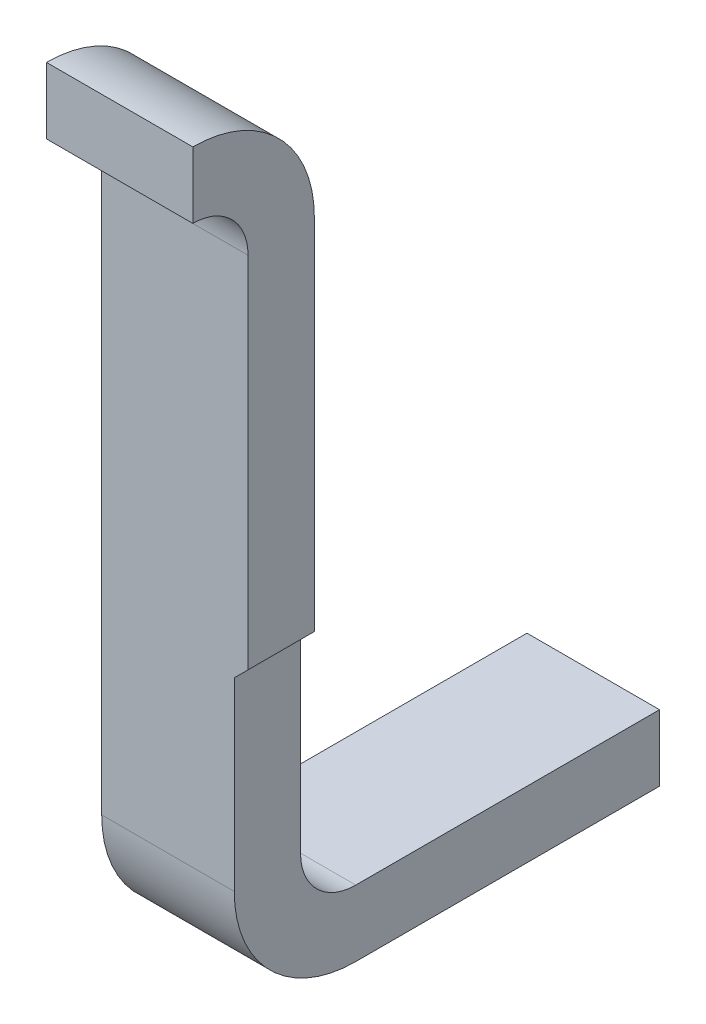
ISO-10303-21;
HEADER;
FILE_DESCRIPTION(('STEP AP214'),'2;1');
FILE_NAME('part.step','',(''),(''),'','','');
FILE_SCHEMA(('AUTOMOTIVE_DESIGN { 1 0 10303 214 1 1 1 1 }'));
ENDSEC;
DATA;
#1=APPLICATION_CONTEXT('core data for automotive mechanical design processes');
#2=APPLICATION_PROTOCOL_DEFINITION('international standard','automotive_design',2000,#1);
#3=PRODUCT_CONTEXT('',#1,'mechanical');
#4=PRODUCT('Part','Part','',(#3));
#5=PRODUCT_RELATED_PRODUCT_CATEGORY('part','',(#4));
#6=PRODUCT_DEFINITION_FORMATION('','',#4);
#7=PRODUCT_DEFINITION_CONTEXT('part definition',#1,'design');
#8=PRODUCT_DEFINITION('design','',#6,#7);
#9=PRODUCT_DEFINITION_SHAPE('','',#8);
#10=(LENGTH_UNIT() NAMED_UNIT(*) SI_UNIT(.MILLI.,.METRE.));
#11=(NAMED_UNIT(*) PLANE_ANGLE_UNIT() SI_UNIT($,.RADIAN.));
#12=(NAMED_UNIT(*) SI_UNIT($,.STERADIAN.) SOLID_ANGLE_UNIT());
#13=UNCERTAINTY_MEASURE_WITH_UNIT(LENGTH_MEASURE(1.E-05),#10,'distance_accuracy_value','');
#14=(GEOMETRIC_REPRESENTATION_CONTEXT(3) GLOBAL_UNCERTAINTY_ASSIGNED_CONTEXT((#13)) GLOBAL_UNIT_ASSIGNED_CONTEXT((#10,
#11,#12)) REPRESENTATION_CONTEXT('',''));
#15=CARTESIAN_POINT('',(0.,0.,0.));
#16=DIRECTION('',(0.,0.,1.));
#17=DIRECTION('',(1.,0.,0.));
#18=AXIS2_PLACEMENT_3D('',#15,#16,#17);
#19=CARTESIAN_POINT('',(13.46210817501,11.48941215274,-11.17169883308));
#20=DIRECTION('',(0.,0.,-1.));
#21=DIRECTION('',(-1.,0.,0.));
#22=AXIS2_PLACEMENT_3D('',#19,#20,#21);
#23=PLANE('',#22);
#24=DIRECTION('',(-1.,0.,0.));
#25=VECTOR('',#24,1.);
#26=CARTESIAN_POINT('',(13.11210817501,12.93951558355,-11.17169883308));
#27=LINE('',#26,#25);
#28=CARTESIAN_POINT('',(13.91210814532,12.93951558355,-11.17169883308));
#29=VERTEX_POINT('',#28);
#30=CARTESIAN_POINT('',(13.64710814532,12.93951558355,-11.17169883308));
#31=VERTEX_POINT('',#30);
#32=EDGE_CURVE('E225',#29,#31,#27,.T.);
#33=ORIENTED_EDGE('',*,*,#32,.T.);
#34=DIRECTION('',(0.,-1.,0.));
#35=VECTOR('',#34,1.);
#36=CARTESIAN_POINT('',(13.64710814532,5.079903349409,-11.17169883308));
#37=LINE('',#36,#35);
#38=CARTESIAN_POINT('',(13.64710814532,12.81951558355,-11.17169883308));
#39=VERTEX_POINT('',#38);
#40=EDGE_CURVE('E219',#31,#39,#37,.T.);
#41=ORIENTED_EDGE('',*,*,#40,.T.);
#42=DIRECTION('',(1.,0.,0.));
#43=VECTOR('',#42,1.);
#44=CARTESIAN_POINT('',(0.,12.81951558355,-11.17169883308));
#45=LINE('',#44,#43);
#46=CARTESIAN_POINT('',(13.91210814532,12.81951558355,-11.17169883308));
#47=VERTEX_POINT('',#46);
#48=EDGE_CURVE('E217',#39,#47,#45,.T.);
#49=ORIENTED_EDGE('',*,*,#48,.T.);
#50=DIRECTION('',(0.,1.,0.));
#51=VECTOR('',#50,1.);
#52=CARTESIAN_POINT('',(13.91210814532,5.079903349409,-11.17169883308));
#53=LINE('',#52,#51);
#54=EDGE_CURVE('E11',#47,#29,#53,.T.);
#55=ORIENTED_EDGE('',*,*,#54,.T.);
#56=EDGE_LOOP('',(#33,#41,#49,#55));
#57=FACE_BOUND('',#56,.T.);
#58=ADVANCED_FACE('F17',(#57),#23,.F.);
#59=CARTESIAN_POINT('',(13.91210814532,11.48951558355,-11.91169883308));
#60=DIRECTION('',(-1.,0.,0.));
#61=DIRECTION('',(0.,1.,0.));
#62=AXIS2_PLACEMENT_3D('',#59,#60,#61);
#63=PLANE('',#62);
#64=CARTESIAN_POINT('',(13.91210814532,12.71951558355,-11.17169883308));
#65=DIRECTION('',(1.,0.,0.));
#66=DIRECTION('',(0.,0.,-1.));
#67=AXIS2_PLACEMENT_3D('',#64,#65,#66);
#68=CIRCLE('',#67,0.1);
#69=CARTESIAN_POINT('',(13.91210814532,12.71951558355,-11.27169883308));
#70=VERTEX_POINT('',#69);
#71=EDGE_CURVE('E220',#70,#47,#68,.T.);
#72=ORIENTED_EDGE('',*,*,#71,.F.);
#73=DIRECTION('',(0.,1.,0.));
#74=VECTOR('',#73,1.);
#75=CARTESIAN_POINT('',(13.91210814532,11.48951558355,-11.27169883308));
#76=LINE('',#75,#74);
#77=CARTESIAN_POINT('',(13.91210814532,12.06951558355,-11.27169883308));
#78=VERTEX_POINT('',#77);
#79=EDGE_CURVE('E194',#78,#70,#76,.T.);
#80=ORIENTED_EDGE('',*,*,#79,.F.);
#81=DIRECTION('',(0.,0.,1.));
#82=VECTOR('',#81,1.);
#83=CARTESIAN_POINT('',(13.91210814532,12.06951558355,-11.91169883308));
#84=LINE('',#83,#82);
#85=CARTESIAN_POINT('',(13.91210814532,12.06951558355,-11.39169883308));
#86=VERTEX_POINT('',#85);
#87=EDGE_CURVE('E146',#86,#78,#84,.T.);
#88=ORIENTED_EDGE('',*,*,#87,.F.);
#89=DIRECTION('',(0.,-1.,0.));
#90=VECTOR('',#89,1.);
#91=CARTESIAN_POINT('',(13.91210814532,11.48951558355,-11.39169883308));
#92=LINE('',#91,#90);
#93=CARTESIAN_POINT('',(13.91210814532,12.71951558355,-11.39169883308));
#94=VERTEX_POINT('',#93);
#95=EDGE_CURVE('E193',#94,#86,#92,.T.);
#96=ORIENTED_EDGE('',*,*,#95,.F.);
#97=CARTESIAN_POINT('',(13.91210814532,12.71951558355,-11.17169883308));
#98=DIRECTION('',(-1.,0.,0.));
#99=DIRECTION('',(0.,0.,1.));
#100=AXIS2_PLACEMENT_3D('',#97,#98,#99);
#101=CIRCLE('',#100,0.22);
#102=EDGE_CURVE('E28',#29,#94,#101,.T.);
#103=ORIENTED_EDGE('',*,*,#102,.F.);
#104=ORIENTED_EDGE('',*,*,#54,.F.);
#105=EDGE_LOOP('',(#72,#80,#88,#96,#103,#104));
#106=FACE_BOUND('',#105,.T.);
#107=ADVANCED_FACE('F287',(#106),#63,.F.);
#108=CARTESIAN_POINT('',(12.81210814532,12.71951558355,-11.17169883308));
#109=DIRECTION('',(1.,0.,0.));
#110=DIRECTION('',(0.,0.,1.));
#111=AXIS2_PLACEMENT_3D('',#108,#109,#110);
#112=CYLINDRICAL_SURFACE('',#111,0.22);
#113=CARTESIAN_POINT('',(13.64710814532,12.71951558355,-11.17169883308));
#114=DIRECTION('',(-1.,0.,0.));
#115=DIRECTION('',(0.,0.,1.));
#116=AXIS2_PLACEMENT_3D('',#113,#114,#115);
#117=CIRCLE('',#116,0.22);
#118=CARTESIAN_POINT('',(13.64710814532,12.71951558355,-11.39169883308));
#119=VERTEX_POINT('',#118);
#120=EDGE_CURVE('E222',#31,#119,#117,.T.);
#121=ORIENTED_EDGE('',*,*,#120,.F.);
#122=ORIENTED_EDGE('',*,*,#32,.F.);
#123=ORIENTED_EDGE('',*,*,#102,.T.);
#124=DIRECTION('',(-1.,0.,0.));
#125=VECTOR('',#124,1.);
#126=CARTESIAN_POINT('',(12.81210814532,12.71951558355,-11.39169883308));
#127=LINE('',#126,#125);
#128=EDGE_CURVE('E192',#94,#119,#127,.T.);
#129=ORIENTED_EDGE('',*,*,#128,.T.);
#130=EDGE_LOOP('',(#121,#122,#123,#129));
#131=FACE_BOUND('',#130,.T.);
#132=ADVANCED_FACE('F429',(#131),#112,.T.);
#133=CARTESIAN_POINT('',(13.64710814532,12.71951558355,-11.17169883308));
#134=DIRECTION('',(-1.,0.,0.));
#135=DIRECTION('',(0.,1.,0.));
#136=AXIS2_PLACEMENT_3D('',#133,#134,#135);
#137=PLANE('',#136);
#138=CARTESIAN_POINT('',(13.64710814532,12.71951558355,-11.17169883308));
#139=DIRECTION('',(1.,0.,0.));
#140=DIRECTION('',(0.,0.,-1.));
#141=AXIS2_PLACEMENT_3D('',#138,#139,#140);
#142=CIRCLE('',#141,0.1);
#143=CARTESIAN_POINT('',(13.64710814532,12.71951558355,-11.27169883308));
#144=VERTEX_POINT('',#143);
#145=EDGE_CURVE('E233',#144,#39,#142,.T.);
#146=ORIENTED_EDGE('',*,*,#145,.T.);
#147=ORIENTED_EDGE('',*,*,#40,.F.);
#148=ORIENTED_EDGE('',*,*,#120,.T.);
#149=DIRECTION('',(0.,-1.,0.));
#150=VECTOR('',#149,1.);
#151=CARTESIAN_POINT('',(13.64710814532,12.71951558355,-11.39169883308));
#152=LINE('',#151,#150);
#153=CARTESIAN_POINT('',(13.64710814532,11.70951558355,-11.39169883308));
#154=VERTEX_POINT('',#153);
#155=EDGE_CURVE('E127',#119,#154,#152,.T.);
#156=ORIENTED_EDGE('',*,*,#155,.T.);
#157=CARTESIAN_POINT('',(13.64710814532,11.70951558355,-11.49169883308));
#158=DIRECTION('',(1.,0.,0.));
#159=DIRECTION('',(0.,0.,1.));
#160=AXIS2_PLACEMENT_3D('',#157,#158,#159);
#161=CIRCLE('',#160,0.1);
#162=CARTESIAN_POINT('',(13.64710814532,11.60951558355,-11.49169883308));
#163=VERTEX_POINT('',#162);
#164=EDGE_CURVE('E119',#154,#163,#161,.T.);
#165=ORIENTED_EDGE('',*,*,#164,.T.);
#166=DIRECTION('',(0.,0.,-1.));
#167=VECTOR('',#166,1.);
#168=CARTESIAN_POINT('',(13.64710814532,11.60951558355,-11.17169883308));
#169=LINE('',#168,#167);
#170=CARTESIAN_POINT('',(13.64710814532,11.60951558355,-12.04169883308));
#171=VERTEX_POINT('',#170);
#172=EDGE_CURVE('E213',#163,#171,#169,.T.);
#173=ORIENTED_EDGE('',*,*,#172,.T.);
#174=DIRECTION('',(0.,-1.,0.));
#175=VECTOR('',#174,1.);
#176=CARTESIAN_POINT('',(13.64710814532,12.71951558355,-12.04169883308));
#177=LINE('',#176,#175);
#178=CARTESIAN_POINT('',(13.64710814532,11.48951558355,-12.04169883308));
#179=VERTEX_POINT('',#178);
#180=EDGE_CURVE('E216',#171,#179,#177,.T.);
#181=ORIENTED_EDGE('',*,*,#180,.T.);
#182=DIRECTION('',(0.,0.,1.));
#183=VECTOR('',#182,1.);
#184=CARTESIAN_POINT('',(13.64710814532,11.48951558355,-11.17169883308));
#185=LINE('',#184,#183);
#186=CARTESIAN_POINT('',(13.64710814532,11.48951558355,-11.49169883308));
#187=VERTEX_POINT('',#186);
#188=EDGE_CURVE('E21',#179,#187,#185,.T.);
#189=ORIENTED_EDGE('',*,*,#188,.T.);
#190=CARTESIAN_POINT('',(13.64710814532,11.70951558355,-11.49169883308));
#191=DIRECTION('',(-1.,0.,0.));
#192=DIRECTION('',(0.,0.,-1.));
#193=AXIS2_PLACEMENT_3D('',#190,#191,#192);
#194=CIRCLE('',#193,0.22);
#195=CARTESIAN_POINT('',(13.64710814532,11.70951558355,-11.27169883308));
#196=VERTEX_POINT('',#195);
#197=EDGE_CURVE('E231',#187,#196,#194,.T.);
#198=ORIENTED_EDGE('',*,*,#197,.T.);
#199=DIRECTION('',(0.,1.,0.));
#200=VECTOR('',#199,1.);
#201=CARTESIAN_POINT('',(13.64710814532,12.71951558355,-11.27169883308));
#202=LINE('',#201,#200);
#203=EDGE_CURVE('E202',#196,#144,#202,.T.);
#204=ORIENTED_EDGE('',*,*,#203,.T.);
#205=EDGE_LOOP('',(#146,#147,#148,#156,#165,#173,#181,#189,#198,#204));
#206=FACE_BOUND('',#205,.T.);
#207=ADVANCED_FACE('F384',(#206),#137,.T.);
#208=CARTESIAN_POINT('',(19.01210814532,12.71951558355,-11.17169883308));
#209=DIRECTION('',(-1.,0.,0.));
#210=DIRECTION('',(0.,0.,-1.));
#211=AXIS2_PLACEMENT_3D('',#208,#209,#210);
#212=CYLINDRICAL_SURFACE('',#211,0.1);
#213=ORIENTED_EDGE('',*,*,#145,.F.);
#214=DIRECTION('',(-1.,0.,0.));
#215=VECTOR('',#214,1.);
#216=CARTESIAN_POINT('',(19.01210814532,12.71951558355,-11.27169883308));
#217=LINE('',#216,#215);
#218=EDGE_CURVE('E196',#70,#144,#217,.T.);
#219=ORIENTED_EDGE('',*,*,#218,.F.);
#220=ORIENTED_EDGE('',*,*,#71,.T.);
#221=ORIENTED_EDGE('',*,*,#48,.F.);
#222=EDGE_LOOP('',(#213,#219,#220,#221));
#223=FACE_BOUND('',#222,.T.);
#224=ADVANCED_FACE('F285',(#223),#212,.F.);
#225=CARTESIAN_POINT('',(13.61210814532,11.48951558355,-11.27169883308));
#226=DIRECTION('',(0.,0.,1.));
#227=DIRECTION('',(1.,0.,0.));
#228=AXIS2_PLACEMENT_3D('',#225,#226,#227);
#229=PLANE('',#228);
#230=DIRECTION('',(0.,1.,0.));
#231=VECTOR('',#230,1.);
#232=CARTESIAN_POINT('',(13.88710814532,11.48951558355,-11.27169883308));
#233=LINE('',#232,#231);
#234=CARTESIAN_POINT('',(13.88710814532,11.70951558355,-11.27169883308));
#235=VERTEX_POINT('',#234);
#236=CARTESIAN_POINT('',(13.88710814532,12.04451558355,-11.27169883308));
#237=VERTEX_POINT('',#236);
#238=EDGE_CURVE('E153',#235,#237,#233,.T.);
#239=ORIENTED_EDGE('',*,*,#238,.T.);
#240=DIRECTION('',(0.707106781186548,0.707106781186548,0.));
#241=VECTOR('',#240,1.);
#242=CARTESIAN_POINT('',(13.88710814532,12.04451558355,-11.27169883308));
#243=LINE('',#242,#241);
#244=EDGE_CURVE('E138',#237,#78,#243,.T.);
#245=ORIENTED_EDGE('',*,*,#244,.T.);
#246=ORIENTED_EDGE('',*,*,#79,.T.);
#247=ORIENTED_EDGE('',*,*,#218,.T.);
#248=ORIENTED_EDGE('',*,*,#203,.F.);
#249=DIRECTION('',(1.,0.,0.));
#250=VECTOR('',#249,1.);
#251=CARTESIAN_POINT('',(13.61210814532,11.70951558355,-11.27169883308));
#252=LINE('',#251,#250);
#253=EDGE_CURVE('E150',#196,#235,#252,.T.);
#254=ORIENTED_EDGE('',*,*,#253,.T.);
#255=EDGE_LOOP('',(#239,#245,#246,#247,#248,#254));
#256=FACE_BOUND('',#255,.T.);
#257=ADVANCED_FACE('F154',(#256),#229,.T.);
#258=CARTESIAN_POINT('',(12.81210814532,12.93951558355,-11.39169883308));
#259=DIRECTION('',(0.,0.,1.));
#260=DIRECTION('',(1.,0.,0.));
#261=AXIS2_PLACEMENT_3D('',#258,#259,#260);
#262=PLANE('',#261);
#263=ORIENTED_EDGE('',*,*,#95,.T.);
#264=DIRECTION('',(0.707106781186548,0.707106781186548,0.));
#265=VECTOR('',#264,1.);
#266=CARTESIAN_POINT('',(13.88710814532,12.04451558355,-11.39169883308));
#267=LINE('',#266,#265);
#268=CARTESIAN_POINT('',(13.88710814532,12.04451558355,-11.39169883308));
#269=VERTEX_POINT('',#268);
#270=EDGE_CURVE('E226',#269,#86,#267,.T.);
#271=ORIENTED_EDGE('',*,*,#270,.F.);
#272=DIRECTION('',(0.,1.,0.));
#273=VECTOR('',#272,1.);
#274=CARTESIAN_POINT('',(13.88710814532,12.93951558355,-11.39169883308));
#275=LINE('',#274,#273);
#276=CARTESIAN_POINT('',(13.88710814532,11.70951558355,-11.39169883308));
#277=VERTEX_POINT('',#276);
#278=EDGE_CURVE('E166',#277,#269,#275,.T.);
#279=ORIENTED_EDGE('',*,*,#278,.F.);
#280=DIRECTION('',(-1.,0.,0.));
#281=VECTOR('',#280,1.);
#282=CARTESIAN_POINT('',(12.81210814532,11.70951558355,-11.39169883308));
#283=LINE('',#282,#281);
#284=EDGE_CURVE('E186',#277,#154,#283,.T.);
#285=ORIENTED_EDGE('',*,*,#284,.T.);
#286=ORIENTED_EDGE('',*,*,#155,.F.);
#287=ORIENTED_EDGE('',*,*,#128,.F.);
#288=EDGE_LOOP('',(#263,#271,#279,#285,#286,#287));
#289=FACE_BOUND('',#288,.T.);
#290=ADVANCED_FACE('F363',(#289),#262,.F.);
#291=CARTESIAN_POINT('',(12.81210814532,11.70951558355,-11.49169883308));
#292=DIRECTION('',(1.,0.,0.));
#293=DIRECTION('',(0.,0.,1.));
#294=AXIS2_PLACEMENT_3D('',#291,#292,#293);
#295=CYLINDRICAL_SURFACE('',#294,0.1);
#296=ORIENTED_EDGE('',*,*,#284,.F.);
#297=CARTESIAN_POINT('',(13.88710814532,11.70951558355,-11.49169883308));
#298=DIRECTION('',(-1.,0.,0.));
#299=DIRECTION('',(0.,0.,1.));
#300=AXIS2_PLACEMENT_3D('',#297,#298,#299);
#301=CIRCLE('',#300,0.1);
#302=CARTESIAN_POINT('',(13.88710814532,11.60951558355,-11.49169883308));
#303=VERTEX_POINT('',#302);
#304=EDGE_CURVE('E173',#303,#277,#301,.T.);
#305=ORIENTED_EDGE('',*,*,#304,.F.);
#306=DIRECTION('',(-1.,0.,0.));
#307=VECTOR('',#306,1.);
#308=CARTESIAN_POINT('',(12.81210814532,11.60951558355,-11.49169883308));
#309=LINE('',#308,#307);
#310=EDGE_CURVE('E190',#303,#163,#309,.T.);
#311=ORIENTED_EDGE('',*,*,#310,.T.);
#312=ORIENTED_EDGE('',*,*,#164,.F.);
#313=EDGE_LOOP('',(#296,#305,#311,#312));
#314=FACE_BOUND('',#313,.T.);
#315=ADVANCED_FACE('F375',(#314),#295,.F.);
#316=CARTESIAN_POINT('',(12.81210814532,11.60951558355,-11.91169883308));
#317=DIRECTION('',(0.,-1.,0.));
#318=DIRECTION('',(0.,0.,-1.));
#319=AXIS2_PLACEMENT_3D('',#316,#317,#318);
#320=PLANE('',#319);
#321=ORIENTED_EDGE('',*,*,#172,.F.);
#322=ORIENTED_EDGE('',*,*,#310,.F.);
#323=DIRECTION('',(0.,0.,1.));
#324=VECTOR('',#323,1.);
#325=CARTESIAN_POINT('',(13.88710814532,11.60951558355,-11.91169883308));
#326=LINE('',#325,#324);
#327=CARTESIAN_POINT('',(13.88710814532,11.60951558355,-12.04169883308));
#328=VERTEX_POINT('',#327);
#329=EDGE_CURVE('E180',#328,#303,#326,.T.);
#330=ORIENTED_EDGE('',*,*,#329,.F.);
#331=DIRECTION('',(-1.,0.,0.));
#332=VECTOR('',#331,1.);
#333=CARTESIAN_POINT('',(12.02567879084,11.60951558355,-12.04169883308));
#334=LINE('',#333,#332);
#335=EDGE_CURVE('E245',#328,#171,#334,.T.);
#336=ORIENTED_EDGE('',*,*,#335,.T.);
#337=EDGE_LOOP('',(#321,#322,#330,#336));
#338=FACE_BOUND('',#337,.T.);
#339=ADVANCED_FACE('F369',(#338),#320,.F.);
#340=CARTESIAN_POINT('',(12.02567879084,1.609515583551,-12.04169883308));
#341=DIRECTION('',(0.,0.,1.));
#342=DIRECTION('',(1.,0.,0.));
#343=AXIS2_PLACEMENT_3D('',#340,#341,#342);
#344=PLANE('',#343);
#345=ORIENTED_EDGE('',*,*,#335,.F.);
#346=DIRECTION('',(0.,1.,0.));
#347=VECTOR('',#346,1.);
#348=CARTESIAN_POINT('',(13.88710814532,1.609515583551,-12.04169883308));
#349=LINE('',#348,#347);
#350=CARTESIAN_POINT('',(13.88710814532,11.48951558355,-12.04169883308));
#351=VERTEX_POINT('',#350);
#352=EDGE_CURVE('E185',#351,#328,#349,.T.);
#353=ORIENTED_EDGE('',*,*,#352,.F.);
#354=DIRECTION('',(1.,0.,0.));
#355=VECTOR('',#354,1.);
#356=CARTESIAN_POINT('',(18.61210814532,11.48951558355,-12.04169883308));
#357=LINE('',#356,#355);
#358=EDGE_CURVE('E242',#179,#351,#357,.T.);
#359=ORIENTED_EDGE('',*,*,#358,.F.);
#360=ORIENTED_EDGE('',*,*,#180,.F.);
#361=EDGE_LOOP('',(#345,#353,#359,#360));
#362=FACE_BOUND('',#361,.T.);
#363=ADVANCED_FACE('F374',(#362),#344,.F.);
#364=CARTESIAN_POINT('',(18.61210814532,11.48951558355,-8.041698833076));
#365=DIRECTION('',(0.,-1.,0.));
#366=DIRECTION('',(0.,0.,-1.));
#367=AXIS2_PLACEMENT_3D('',#364,#365,#366);
#368=PLANE('',#367);
#369=ORIENTED_EDGE('',*,*,#188,.F.);
#370=ORIENTED_EDGE('',*,*,#358,.T.);
#371=DIRECTION('',(0.,0.,1.));
#372=VECTOR('',#371,1.);
#373=CARTESIAN_POINT('',(13.88710814532,11.48951558355,-8.041698833076));
#374=LINE('',#373,#372);
#375=CARTESIAN_POINT('',(13.88710814532,11.48951558355,-11.49169883308));
#376=VERTEX_POINT('',#375);
#377=EDGE_CURVE('E181',#351,#376,#374,.T.);
#378=ORIENTED_EDGE('',*,*,#377,.T.);
#379=DIRECTION('',(1.,0.,0.));
#380=VECTOR('',#379,1.);
#381=CARTESIAN_POINT('',(13.61210814532,11.48951558355,-11.49169883308));
#382=LINE('',#381,#380);
#383=EDGE_CURVE('E229',#187,#376,#382,.T.);
#384=ORIENTED_EDGE('',*,*,#383,.F.);
#385=EDGE_LOOP('',(#369,#370,#378,#384));
#386=FACE_BOUND('',#385,.T.);
#387=ADVANCED_FACE('F420',(#386),#368,.T.);
#388=CARTESIAN_POINT('',(13.61210814532,11.70951558355,-11.49169883308));
#389=DIRECTION('',(-1.,0.,0.));
#390=DIRECTION('',(0.,0.,-1.));
#391=AXIS2_PLACEMENT_3D('',#388,#389,#390);
#392=CYLINDRICAL_SURFACE('',#391,0.22);
#393=ORIENTED_EDGE('',*,*,#253,.F.);
#394=ORIENTED_EDGE('',*,*,#197,.F.);
#395=ORIENTED_EDGE('',*,*,#383,.T.);
#396=CARTESIAN_POINT('',(13.88710814532,11.70951558355,-11.49169883308));
#397=DIRECTION('',(-1.,0.,0.));
#398=DIRECTION('',(0.,0.,-1.));
#399=AXIS2_PLACEMENT_3D('',#396,#397,#398);
#400=CIRCLE('',#399,0.22);
#401=EDGE_CURVE('E160',#376,#235,#400,.T.);
#402=ORIENTED_EDGE('',*,*,#401,.T.);
#403=EDGE_LOOP('',(#393,#394,#395,#402));
#404=FACE_BOUND('',#403,.T.);
#405=ADVANCED_FACE('F19',(#404),#392,.T.);
#406=CARTESIAN_POINT('',(13.88210814532,12.03951558355,-8.041698833076));
#407=DIRECTION('',(0.707106781186048,-0.707106781187048,0.));
#408=DIRECTION('',(0.,0.,-1.));
#409=AXIS2_PLACEMENT_3D('',#406,#407,#408);
#410=PLANE('',#409);
#411=DIRECTION('',(0.,0.,-1.));
#412=VECTOR('',#411,1.);
#413=CARTESIAN_POINT('',(13.88710814532,12.04451558355,-8.041698833076));
#414=LINE('',#413,#412);
#415=EDGE_CURVE('E143',#237,#269,#414,.T.);
#416=ORIENTED_EDGE('',*,*,#415,.T.);
#417=ORIENTED_EDGE('',*,*,#270,.T.);
#418=ORIENTED_EDGE('',*,*,#87,.T.);
#419=ORIENTED_EDGE('',*,*,#244,.F.);
#420=EDGE_LOOP('',(#416,#417,#418,#419));
#421=FACE_BOUND('',#420,.T.);
#422=ADVANCED_FACE('F140',(#421),#410,.T.);
#423=CARTESIAN_POINT('',(13.88710814532,12.03951558355,-11.27169883308));
#424=DIRECTION('',(-1.,0.,0.));
#425=DIRECTION('',(0.,1.,0.));
#426=AXIS2_PLACEMENT_3D('',#423,#424,#425);
#427=PLANE('',#426);
#428=ORIENTED_EDGE('',*,*,#329,.T.);
#429=ORIENTED_EDGE('',*,*,#304,.T.);
#430=ORIENTED_EDGE('',*,*,#278,.T.);
#431=ORIENTED_EDGE('',*,*,#415,.F.);
#432=ORIENTED_EDGE('',*,*,#238,.F.);
#433=ORIENTED_EDGE('',*,*,#401,.F.);
#434=ORIENTED_EDGE('',*,*,#377,.F.);
#435=ORIENTED_EDGE('',*,*,#352,.T.);
#436=EDGE_LOOP('',(#428,#429,#430,#431,#432,#433,#434,#435));
#437=FACE_BOUND('',#436,.T.);
#438=ADVANCED_FACE('F163',(#437),#427,.F.);
#439=CLOSED_SHELL('',(#58,#107,#132,#207,#224,#257,#290,#315,#339,#363,#387,#405,#422,#438));
#440=MANIFOLD_SOLID_BREP('B1',#439);
#441=ADVANCED_BREP_SHAPE_REPRESENTATION('',(#18,#440),#14);
#442=SHAPE_DEFINITION_REPRESENTATION(#9,#441);
ENDSEC;
END-ISO-10303-21;
